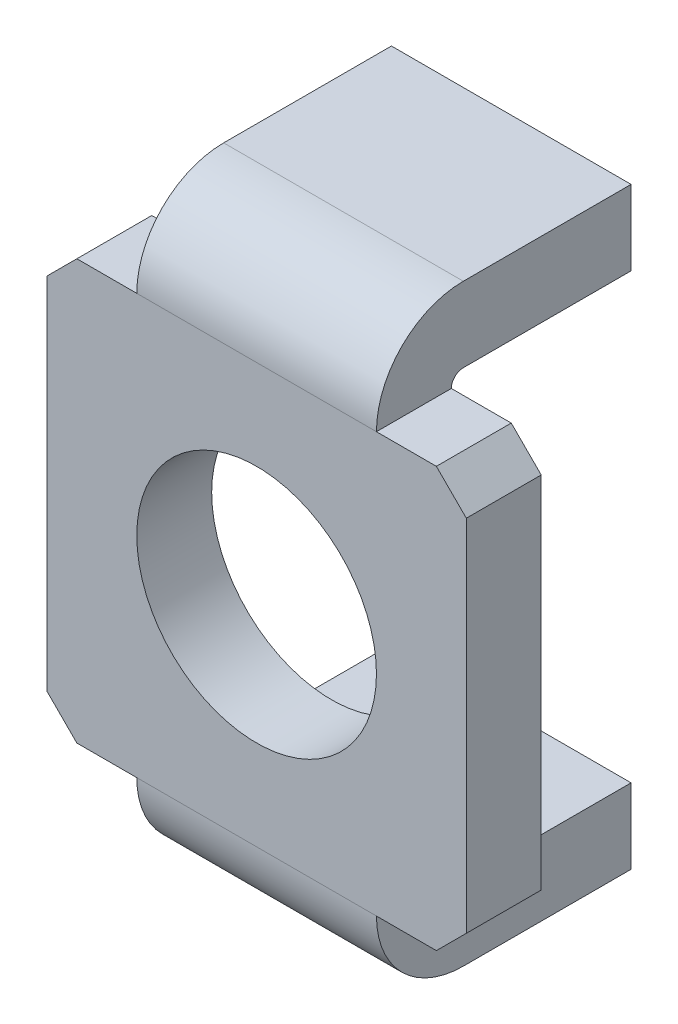
ISO-10303-21;
HEADER;
FILE_DESCRIPTION(('STEP AP214'),'2;1');
FILE_NAME('part.step','',(''),(''),'','','');
FILE_SCHEMA(('AUTOMOTIVE_DESIGN { 1 0 10303 214 1 1 1 1 }'));
ENDSEC;
DATA;
#1=APPLICATION_CONTEXT('core data for automotive mechanical design processes');
#2=APPLICATION_PROTOCOL_DEFINITION('international standard','automotive_design',2000,#1);
#3=PRODUCT_CONTEXT('',#1,'mechanical');
#4=PRODUCT('Part','Part','',(#3));
#5=PRODUCT_RELATED_PRODUCT_CATEGORY('part','',(#4));
#6=PRODUCT_DEFINITION_FORMATION('','',#4);
#7=PRODUCT_DEFINITION_CONTEXT('part definition',#1,'design');
#8=PRODUCT_DEFINITION('design','',#6,#7);
#9=PRODUCT_DEFINITION_SHAPE('','',#8);
#10=(LENGTH_UNIT() NAMED_UNIT(*) SI_UNIT(.MILLI.,.METRE.));
#11=(NAMED_UNIT(*) PLANE_ANGLE_UNIT() SI_UNIT($,.RADIAN.));
#12=(NAMED_UNIT(*) SI_UNIT($,.STERADIAN.) SOLID_ANGLE_UNIT());
#13=UNCERTAINTY_MEASURE_WITH_UNIT(LENGTH_MEASURE(1.E-05),#10,'distance_accuracy_value','');
#14=(GEOMETRIC_REPRESENTATION_CONTEXT(3) GLOBAL_UNCERTAINTY_ASSIGNED_CONTEXT((#13)) GLOBAL_UNIT_ASSIGNED_CONTEXT((#10,
#11,#12)) REPRESENTATION_CONTEXT('',''));
#15=CARTESIAN_POINT('',(0.,0.,0.));
#16=DIRECTION('',(0.,0.,1.));
#17=DIRECTION('',(1.,0.,0.));
#18=AXIS2_PLACEMENT_3D('',#15,#16,#17);
#19=CARTESIAN_POINT('',(0.,-4.95,0.));
#20=DIRECTION('',(0.,1.,0.));
#21=DIRECTION('',(0.,0.,1.));
#22=AXIS2_PLACEMENT_3D('',#19,#20,#21);
#23=PLANE('',#22);
#24=DIRECTION('',(0.,0.,1.));
#25=VECTOR('',#24,1.);
#26=CARTESIAN_POINT('',(-2.,-4.95000000000001,-4.25));
#27=LINE('',#26,#25);
#28=CARTESIAN_POINT('',(-2.,-4.95000000000001,-4.25));
#29=VERTEX_POINT('',#28);
#30=CARTESIAN_POINT('',(-2.,-4.95000000000001,-1.45));
#31=VERTEX_POINT('',#30);
#32=EDGE_CURVE('E189',#29,#31,#27,.T.);
#33=ORIENTED_EDGE('',*,*,#32,.F.);
#34=DIRECTION('',(1.,0.,0.));
#35=VECTOR('',#34,1.);
#36=CARTESIAN_POINT('',(-2.,-4.95000000000001,-4.25));
#37=LINE('',#36,#35);
#38=CARTESIAN_POINT('',(2.,-4.95,-4.25));
#39=VERTEX_POINT('',#38);
#40=EDGE_CURVE('E199',#39,#29,#37,.F.);
#41=ORIENTED_EDGE('',*,*,#40,.F.);
#42=DIRECTION('',(0.,0.,-1.));
#43=VECTOR('',#42,1.);
#44=CARTESIAN_POINT('',(2.,-4.95,-4.25));
#45=LINE('',#44,#43);
#46=CARTESIAN_POINT('',(2.,-4.95,-1.45));
#47=VERTEX_POINT('',#46);
#48=EDGE_CURVE('E192',#47,#39,#45,.T.);
#49=ORIENTED_EDGE('',*,*,#48,.F.);
#50=DIRECTION('',(-1.,0.,0.));
#51=VECTOR('',#50,1.);
#52=CARTESIAN_POINT('',(-2.,-4.95,-1.44999999999999));
#53=LINE('',#52,#51);
#54=EDGE_CURVE('E253',#31,#47,#53,.F.);
#55=ORIENTED_EDGE('',*,*,#54,.F.);
#56=EDGE_LOOP('',(#33,#41,#49,#55));
#57=FACE_BOUND('',#56,.T.);
#58=ADVANCED_FACE('F17',(#57),#23,.F.);
#59=CARTESIAN_POINT('',(0.,4.95,0.));
#60=DIRECTION('',(0.,-1.,0.));
#61=DIRECTION('',(0.,0.,-1.));
#62=AXIS2_PLACEMENT_3D('',#59,#60,#61);
#63=PLANE('',#62);
#64=DIRECTION('',(0.,0.,1.));
#65=VECTOR('',#64,1.);
#66=CARTESIAN_POINT('',(2.,4.95,-4.25));
#67=LINE('',#66,#65);
#68=CARTESIAN_POINT('',(2.,4.95,-1.45));
#69=VERTEX_POINT('',#68);
#70=CARTESIAN_POINT('',(2.,4.95000000000001,-4.25));
#71=VERTEX_POINT('',#70);
#72=EDGE_CURVE('E245',#69,#71,#67,.F.);
#73=ORIENTED_EDGE('',*,*,#72,.T.);
#74=DIRECTION('',(1.,0.,0.));
#75=VECTOR('',#74,1.);
#76=CARTESIAN_POINT('',(-2.,4.95000000000001,-4.25));
#77=LINE('',#76,#75);
#78=CARTESIAN_POINT('',(-2.,4.95000000000001,-4.25));
#79=VERTEX_POINT('',#78);
#80=EDGE_CURVE('E332',#71,#79,#77,.F.);
#81=ORIENTED_EDGE('',*,*,#80,.T.);
#82=DIRECTION('',(0.,0.,-1.));
#83=VECTOR('',#82,1.);
#84=CARTESIAN_POINT('',(-2.,4.95000000000001,-4.25));
#85=LINE('',#84,#83);
#86=CARTESIAN_POINT('',(-2.,4.95000000000001,-1.45));
#87=VERTEX_POINT('',#86);
#88=EDGE_CURVE('E337',#79,#87,#85,.F.);
#89=ORIENTED_EDGE('',*,*,#88,.T.);
#90=DIRECTION('',(1.,0.,0.));
#91=VECTOR('',#90,1.);
#92=CARTESIAN_POINT('',(2.,4.95,-1.45));
#93=LINE('',#92,#91);
#94=EDGE_CURVE('E246',#69,#87,#93,.F.);
#95=ORIENTED_EDGE('',*,*,#94,.F.);
#96=EDGE_LOOP('',(#73,#81,#89,#95));
#97=FACE_BOUND('',#96,.T.);
#98=ADVANCED_FACE('F349',(#97),#63,.F.);
#99=CARTESIAN_POINT('',(-2.,-4.95000000000001,-4.25));
#100=DIRECTION('',(-1.,0.,0.));
#101=DIRECTION('',(0.,0.,1.));
#102=AXIS2_PLACEMENT_3D('',#99,#100,#101);
#103=PLANE('',#102);
#104=DIRECTION('',(0.,0.,1.));
#105=VECTOR('',#104,1.);
#106=CARTESIAN_POINT('',(-2.,-3.7,0.));
#107=LINE('',#106,#105);
#108=CARTESIAN_POINT('',(-2.,-3.70000000000001,-4.25));
#109=VERTEX_POINT('',#108);
#110=CARTESIAN_POINT('',(-2.,-3.7,-1.45));
#111=VERTEX_POINT('',#110);
#112=EDGE_CURVE('E154',#109,#111,#107,.T.);
#113=ORIENTED_EDGE('',*,*,#112,.F.);
#114=DIRECTION('',(0.,1.,0.));
#115=VECTOR('',#114,1.);
#116=CARTESIAN_POINT('',(-2.,-4.95000000000001,-4.25));
#117=LINE('',#116,#115);
#118=EDGE_CURVE('E196',#29,#109,#117,.T.);
#119=ORIENTED_EDGE('',*,*,#118,.F.);
#120=ORIENTED_EDGE('',*,*,#32,.T.);
#121=CARTESIAN_POINT('',(-2.,-3.5,-1.45));
#122=DIRECTION('',(-1.,0.,0.));
#123=DIRECTION('',(0.,0.,1.));
#124=AXIS2_PLACEMENT_3D('',#121,#122,#123);
#125=CIRCLE('',#124,1.45);
#126=CARTESIAN_POINT('',(-2.,-3.5,0.));
#127=VERTEX_POINT('',#126);
#128=EDGE_CURVE('E198',#127,#31,#125,.F.);
#129=ORIENTED_EDGE('',*,*,#128,.F.);
#130=DIRECTION('',(0.,0.,-1.));
#131=VECTOR('',#130,1.);
#132=CARTESIAN_POINT('',(-2.,-3.5,-1.45));
#133=LINE('',#132,#131);
#134=CARTESIAN_POINT('',(-2.,-3.5,-1.25));
#135=VERTEX_POINT('',#134);
#136=EDGE_CURVE('E157',#135,#127,#133,.F.);
#137=ORIENTED_EDGE('',*,*,#136,.F.);
#138=CARTESIAN_POINT('',(-2.,-3.5,-1.45));
#139=DIRECTION('',(-1.,0.,0.));
#140=DIRECTION('',(0.,0.,1.));
#141=AXIS2_PLACEMENT_3D('',#138,#139,#140);
#142=CIRCLE('',#141,0.2);
#143=EDGE_CURVE('E20',#111,#135,#142,.T.);
#144=ORIENTED_EDGE('',*,*,#143,.F.);
#145=EDGE_LOOP('',(#113,#119,#120,#129,#137,#144));
#146=FACE_BOUND('',#145,.T.);
#147=ADVANCED_FACE('F152',(#146),#103,.T.);
#148=CARTESIAN_POINT('',(2.,-4.95000000000001,-4.25));
#149=DIRECTION('',(1.,0.,0.));
#150=DIRECTION('',(0.,0.,-1.));
#151=AXIS2_PLACEMENT_3D('',#148,#149,#150);
#152=PLANE('',#151);
#153=ORIENTED_EDGE('',*,*,#48,.T.);
#154=DIRECTION('',(0.,1.,0.));
#155=VECTOR('',#154,1.);
#156=CARTESIAN_POINT('',(2.,-4.95000000000001,-4.25));
#157=LINE('',#156,#155);
#158=CARTESIAN_POINT('',(2.,-3.70000000000001,-4.25));
#159=VERTEX_POINT('',#158);
#160=EDGE_CURVE('E276',#159,#39,#157,.F.);
#161=ORIENTED_EDGE('',*,*,#160,.F.);
#162=DIRECTION('',(0.,0.,1.));
#163=VECTOR('',#162,1.);
#164=CARTESIAN_POINT('',(2.,-3.7,0.));
#165=LINE('',#164,#163);
#166=CARTESIAN_POINT('',(2.,-3.7,-1.45));
#167=VERTEX_POINT('',#166);
#168=EDGE_CURVE('E171',#167,#159,#165,.F.);
#169=ORIENTED_EDGE('',*,*,#168,.F.);
#170=CARTESIAN_POINT('',(2.,-3.5,-1.45));
#171=DIRECTION('',(-1.,0.,0.));
#172=DIRECTION('',(0.,0.,1.));
#173=AXIS2_PLACEMENT_3D('',#170,#171,#172);
#174=CIRCLE('',#173,0.2);
#175=CARTESIAN_POINT('',(2.,-3.5,-1.25));
#176=VERTEX_POINT('',#175);
#177=EDGE_CURVE('E162',#167,#176,#174,.T.);
#178=ORIENTED_EDGE('',*,*,#177,.T.);
#179=DIRECTION('',(0.,0.,-1.));
#180=VECTOR('',#179,1.);
#181=CARTESIAN_POINT('',(2.,-3.5,-1.45));
#182=LINE('',#181,#180);
#183=CARTESIAN_POINT('',(2.,-3.5,0.));
#184=VERTEX_POINT('',#183);
#185=EDGE_CURVE('E260',#176,#184,#182,.F.);
#186=ORIENTED_EDGE('',*,*,#185,.T.);
#187=CARTESIAN_POINT('',(2.,-3.5,-1.45));
#188=DIRECTION('',(-1.,0.,0.));
#189=DIRECTION('',(0.,0.,1.));
#190=AXIS2_PLACEMENT_3D('',#187,#188,#189);
#191=CIRCLE('',#190,1.45);
#192=EDGE_CURVE('E250',#47,#184,#191,.T.);
#193=ORIENTED_EDGE('',*,*,#192,.F.);
#194=EDGE_LOOP('',(#153,#161,#169,#178,#186,#193));
#195=FACE_BOUND('',#194,.T.);
#196=ADVANCED_FACE('F288',(#195),#152,.T.);
#197=CARTESIAN_POINT('',(-2.,-4.95000000000001,-4.25));
#198=DIRECTION('',(0.,0.,-1.));
#199=DIRECTION('',(0.,1.,0.));
#200=AXIS2_PLACEMENT_3D('',#197,#198,#199);
#201=PLANE('',#200);
#202=ORIENTED_EDGE('',*,*,#40,.T.);
#203=ORIENTED_EDGE('',*,*,#118,.T.);
#204=DIRECTION('',(1.,0.,0.));
#205=VECTOR('',#204,1.);
#206=CARTESIAN_POINT('',(0.,-3.70000000000001,-4.25));
#207=LINE('',#206,#205);
#208=EDGE_CURVE('E170',#159,#109,#207,.F.);
#209=ORIENTED_EDGE('',*,*,#208,.F.);
#210=ORIENTED_EDGE('',*,*,#160,.T.);
#211=EDGE_LOOP('',(#202,#203,#209,#210));
#212=FACE_BOUND('',#211,.T.);
#213=ADVANCED_FACE('F286',(#212),#201,.T.);
#214=CARTESIAN_POINT('',(-2.,-3.5,-1.45));
#215=DIRECTION('',(-1.,0.,0.));
#216=DIRECTION('',(0.,0.,1.));
#217=AXIS2_PLACEMENT_3D('',#214,#215,#216);
#218=CYLINDRICAL_SURFACE('',#217,1.45);
#219=ORIENTED_EDGE('',*,*,#54,.T.);
#220=ORIENTED_EDGE('',*,*,#192,.T.);
#221=DIRECTION('',(-1.,0.,0.));
#222=VECTOR('',#221,1.);
#223=CARTESIAN_POINT('',(0.,-3.50000000000001,0.));
#224=LINE('',#223,#222);
#225=EDGE_CURVE('E270',#184,#127,#224,.T.);
#226=ORIENTED_EDGE('',*,*,#225,.T.);
#227=ORIENTED_EDGE('',*,*,#128,.T.);
#228=EDGE_LOOP('',(#219,#220,#226,#227));
#229=FACE_BOUND('',#228,.T.);
#230=ADVANCED_FACE('F294',(#229),#218,.T.);
#231=CARTESIAN_POINT('',(2.,3.5,-1.45));
#232=DIRECTION('',(1.,0.,0.));
#233=DIRECTION('',(0.,0.,-1.));
#234=AXIS2_PLACEMENT_3D('',#231,#232,#233);
#235=CYLINDRICAL_SURFACE('',#234,1.45);
#236=ORIENTED_EDGE('',*,*,#94,.T.);
#237=CARTESIAN_POINT('',(-2.,3.5,-1.45));
#238=DIRECTION('',(1.,0.,0.));
#239=DIRECTION('',(0.,0.,-1.));
#240=AXIS2_PLACEMENT_3D('',#237,#238,#239);
#241=CIRCLE('',#240,1.45);
#242=CARTESIAN_POINT('',(-2.,3.5,0.));
#243=VERTEX_POINT('',#242);
#244=EDGE_CURVE('E242',#87,#243,#241,.T.);
#245=ORIENTED_EDGE('',*,*,#244,.T.);
#246=DIRECTION('',(-1.,0.,0.));
#247=VECTOR('',#246,1.);
#248=CARTESIAN_POINT('',(0.,3.5,0.));
#249=LINE('',#248,#247);
#250=CARTESIAN_POINT('',(2.,3.5,0.));
#251=VERTEX_POINT('',#250);
#252=EDGE_CURVE('E343',#243,#251,#249,.F.);
#253=ORIENTED_EDGE('',*,*,#252,.T.);
#254=CARTESIAN_POINT('',(2.,3.5,-1.45));
#255=DIRECTION('',(1.,0.,0.));
#256=DIRECTION('',(0.,0.,-1.));
#257=AXIS2_PLACEMENT_3D('',#254,#255,#256);
#258=CIRCLE('',#257,1.45);
#259=EDGE_CURVE('E247',#251,#69,#258,.F.);
#260=ORIENTED_EDGE('',*,*,#259,.T.);
#261=EDGE_LOOP('',(#236,#245,#253,#260));
#262=FACE_BOUND('',#261,.T.);
#263=ADVANCED_FACE('F367',(#262),#235,.T.);
#264=CARTESIAN_POINT('',(2.,4.95000000000001,-4.25));
#265=DIRECTION('',(-1.,0.,0.));
#266=DIRECTION('',(0.,0.,1.));
#267=AXIS2_PLACEMENT_3D('',#264,#265,#266);
#268=PLANE('',#267);
#269=DIRECTION('',(0.,0.,-1.));
#270=VECTOR('',#269,1.);
#271=CARTESIAN_POINT('',(2.,3.7,0.));
#272=LINE('',#271,#270);
#273=CARTESIAN_POINT('',(2.,3.70000000000001,-4.25));
#274=VERTEX_POINT('',#273);
#275=CARTESIAN_POINT('',(2.,3.7,-1.45));
#276=VERTEX_POINT('',#275);
#277=EDGE_CURVE('E213',#274,#276,#272,.F.);
#278=ORIENTED_EDGE('',*,*,#277,.F.);
#279=DIRECTION('',(0.,-1.,0.));
#280=VECTOR('',#279,1.);
#281=CARTESIAN_POINT('',(2.,4.95000000000001,-4.25));
#282=LINE('',#281,#280);
#283=EDGE_CURVE('E334',#274,#71,#282,.F.);
#284=ORIENTED_EDGE('',*,*,#283,.T.);
#285=ORIENTED_EDGE('',*,*,#72,.F.);
#286=ORIENTED_EDGE('',*,*,#259,.F.);
#287=DIRECTION('',(0.,0.,1.));
#288=VECTOR('',#287,1.);
#289=CARTESIAN_POINT('',(2.,3.5,-1.45));
#290=LINE('',#289,#288);
#291=CARTESIAN_POINT('',(2.,3.5,-1.25));
#292=VERTEX_POINT('',#291);
#293=EDGE_CURVE('E259',#292,#251,#290,.T.);
#294=ORIENTED_EDGE('',*,*,#293,.F.);
#295=CARTESIAN_POINT('',(2.,3.5,-1.45));
#296=DIRECTION('',(1.,0.,0.));
#297=DIRECTION('',(0.,0.,-1.));
#298=AXIS2_PLACEMENT_3D('',#295,#296,#297);
#299=CIRCLE('',#298,0.2);
#300=EDGE_CURVE('E258',#276,#292,#299,.T.);
#301=ORIENTED_EDGE('',*,*,#300,.F.);
#302=EDGE_LOOP('',(#278,#284,#285,#286,#294,#301));
#303=FACE_BOUND('',#302,.T.);
#304=ADVANCED_FACE('F355',(#303),#268,.F.);
#305=CARTESIAN_POINT('',(-2.,4.95000000000001,-4.25));
#306=DIRECTION('',(1.,0.,0.));
#307=DIRECTION('',(0.,0.,-1.));
#308=AXIS2_PLACEMENT_3D('',#305,#306,#307);
#309=PLANE('',#308);
#310=ORIENTED_EDGE('',*,*,#88,.F.);
#311=DIRECTION('',(0.,-1.,0.));
#312=VECTOR('',#311,1.);
#313=CARTESIAN_POINT('',(-2.,4.95000000000001,-4.25));
#314=LINE('',#313,#312);
#315=CARTESIAN_POINT('',(-2.,3.70000000000001,-4.25));
#316=VERTEX_POINT('',#315);
#317=EDGE_CURVE('E172',#79,#316,#314,.T.);
#318=ORIENTED_EDGE('',*,*,#317,.T.);
#319=DIRECTION('',(0.,0.,-1.));
#320=VECTOR('',#319,1.);
#321=CARTESIAN_POINT('',(-2.,3.7,0.));
#322=LINE('',#321,#320);
#323=CARTESIAN_POINT('',(-2.,3.7,-1.45));
#324=VERTEX_POINT('',#323);
#325=EDGE_CURVE('E209',#324,#316,#322,.T.);
#326=ORIENTED_EDGE('',*,*,#325,.F.);
#327=CARTESIAN_POINT('',(-2.,3.5,-1.45));
#328=DIRECTION('',(1.,0.,0.));
#329=DIRECTION('',(0.,0.,-1.));
#330=AXIS2_PLACEMENT_3D('',#327,#328,#329);
#331=CIRCLE('',#330,0.2);
#332=CARTESIAN_POINT('',(-2.,3.5,-1.25));
#333=VERTEX_POINT('',#332);
#334=EDGE_CURVE('E255',#324,#333,#331,.T.);
#335=ORIENTED_EDGE('',*,*,#334,.T.);
#336=DIRECTION('',(0.,0.,1.));
#337=VECTOR('',#336,1.);
#338=CARTESIAN_POINT('',(-2.,3.5,-1.45));
#339=LINE('',#338,#337);
#340=EDGE_CURVE('E193',#333,#243,#339,.T.);
#341=ORIENTED_EDGE('',*,*,#340,.T.);
#342=ORIENTED_EDGE('',*,*,#244,.F.);
#343=EDGE_LOOP('',(#310,#318,#326,#335,#341,#342));
#344=FACE_BOUND('',#343,.T.);
#345=ADVANCED_FACE('F363',(#344),#309,.F.);
#346=CARTESIAN_POINT('',(-2.,4.95000000000001,-4.25));
#347=DIRECTION('',(0.,0.,1.));
#348=DIRECTION('',(0.,-1.,0.));
#349=AXIS2_PLACEMENT_3D('',#346,#347,#348);
#350=PLANE('',#349);
#351=ORIENTED_EDGE('',*,*,#317,.F.);
#352=ORIENTED_EDGE('',*,*,#80,.F.);
#353=ORIENTED_EDGE('',*,*,#283,.F.);
#354=DIRECTION('',(1.,0.,0.));
#355=VECTOR('',#354,1.);
#356=CARTESIAN_POINT('',(0.,3.70000000000001,-4.25));
#357=LINE('',#356,#355);
#358=EDGE_CURVE('E212',#316,#274,#357,.T.);
#359=ORIENTED_EDGE('',*,*,#358,.F.);
#360=EDGE_LOOP('',(#351,#352,#353,#359));
#361=FACE_BOUND('',#360,.T.);
#362=ADVANCED_FACE('F360',(#361),#350,.F.);
#363=CARTESIAN_POINT('',(0.,-3.7,0.));
#364=DIRECTION('',(0.,1.,0.));
#365=DIRECTION('',(0.,0.,1.));
#366=AXIS2_PLACEMENT_3D('',#363,#364,#365);
#367=PLANE('',#366);
#368=ORIENTED_EDGE('',*,*,#168,.T.);
#369=ORIENTED_EDGE('',*,*,#208,.T.);
#370=ORIENTED_EDGE('',*,*,#112,.T.);
#371=DIRECTION('',(-1.,0.,0.));
#372=VECTOR('',#371,1.);
#373=CARTESIAN_POINT('',(-2.,-3.7,-1.45));
#374=LINE('',#373,#372);
#375=EDGE_CURVE('E168',#111,#167,#374,.F.);
#376=ORIENTED_EDGE('',*,*,#375,.T.);
#377=EDGE_LOOP('',(#368,#369,#370,#376));
#378=FACE_BOUND('',#377,.T.);
#379=ADVANCED_FACE('F167',(#378),#367,.T.);
#380=CARTESIAN_POINT('',(0.,0.,0.));
#381=DIRECTION('',(0.,0.,-1.));
#382=DIRECTION('',(-1.,0.,0.));
#383=AXIS2_PLACEMENT_3D('',#380,#381,#382);
#384=PLANE('',#383);
#385=DIRECTION('',(-0.707106781186547,-0.707106781186548,0.));
#386=VECTOR('',#385,1.);
#387=CARTESIAN_POINT('',(3.,-3.5,0.));
#388=LINE('',#387,#386);
#389=CARTESIAN_POINT('',(3.,-3.5,0.));
#390=VERTEX_POINT('',#389);
#391=CARTESIAN_POINT('',(3.5,-2.99999999999999,0.));
#392=VERTEX_POINT('',#391);
#393=EDGE_CURVE('E321',#390,#392,#388,.F.);
#394=ORIENTED_EDGE('',*,*,#393,.T.);
#395=DIRECTION('',(0.,1.,0.));
#396=VECTOR('',#395,1.);
#397=CARTESIAN_POINT('',(3.5,3.5,0.));
#398=LINE('',#397,#396);
#399=CARTESIAN_POINT('',(3.5,3.,0.));
#400=VERTEX_POINT('',#399);
#401=EDGE_CURVE('E241',#400,#392,#398,.F.);
#402=ORIENTED_EDGE('',*,*,#401,.F.);
#403=DIRECTION('',(0.707106781186549,-0.707106781186546,0.));
#404=VECTOR('',#403,1.);
#405=CARTESIAN_POINT('',(3.,3.5,0.));
#406=LINE('',#405,#404);
#407=CARTESIAN_POINT('',(2.99999999999999,3.5,0.));
#408=VERTEX_POINT('',#407);
#409=EDGE_CURVE('E223',#408,#400,#406,.T.);
#410=ORIENTED_EDGE('',*,*,#409,.F.);
#411=DIRECTION('',(-1.,0.,0.));
#412=VECTOR('',#411,1.);
#413=CARTESIAN_POINT('',(0.,3.5,0.));
#414=LINE('',#413,#412);
#415=EDGE_CURVE('E267',#251,#408,#414,.F.);
#416=ORIENTED_EDGE('',*,*,#415,.F.);
#417=ORIENTED_EDGE('',*,*,#252,.F.);
#418=DIRECTION('',(-1.,0.,0.));
#419=VECTOR('',#418,1.);
#420=CARTESIAN_POINT('',(0.,3.5,0.));
#421=LINE('',#420,#419);
#422=CARTESIAN_POINT('',(-3.,3.5,0.));
#423=VERTEX_POINT('',#422);
#424=EDGE_CURVE('E329',#423,#243,#421,.F.);
#425=ORIENTED_EDGE('',*,*,#424,.F.);
#426=DIRECTION('',(0.707106781186547,0.707106781186548,0.));
#427=VECTOR('',#426,1.);
#428=CARTESIAN_POINT('',(-3.5,3.,0.));
#429=LINE('',#428,#427);
#430=CARTESIAN_POINT('',(-3.5,3.,0.));
#431=VERTEX_POINT('',#430);
#432=EDGE_CURVE('E272',#431,#423,#429,.T.);
#433=ORIENTED_EDGE('',*,*,#432,.F.);
#434=DIRECTION('',(0.,-1.,0.));
#435=VECTOR('',#434,1.);
#436=CARTESIAN_POINT('',(-3.5,3.5,0.));
#437=LINE('',#436,#435);
#438=CARTESIAN_POINT('',(-3.5,-3.,0.));
#439=VERTEX_POINT('',#438);
#440=EDGE_CURVE('E312',#439,#431,#437,.F.);
#441=ORIENTED_EDGE('',*,*,#440,.F.);
#442=DIRECTION('',(-0.707106781186549,0.707106781186546,0.));
#443=VECTOR('',#442,1.);
#444=CARTESIAN_POINT('',(-3.5,-3.,0.));
#445=LINE('',#444,#443);
#446=CARTESIAN_POINT('',(-3.,-3.5,0.));
#447=VERTEX_POINT('',#446);
#448=EDGE_CURVE('E181',#439,#447,#445,.F.);
#449=ORIENTED_EDGE('',*,*,#448,.T.);
#450=DIRECTION('',(1.,0.,0.));
#451=VECTOR('',#450,1.);
#452=CARTESIAN_POINT('',(3.5,-3.5,0.));
#453=LINE('',#452,#451);
#454=EDGE_CURVE('E177',#127,#447,#453,.F.);
#455=ORIENTED_EDGE('',*,*,#454,.F.);
#456=ORIENTED_EDGE('',*,*,#225,.F.);
#457=DIRECTION('',(1.,0.,0.));
#458=VECTOR('',#457,1.);
#459=CARTESIAN_POINT('',(3.5,-3.5,0.));
#460=LINE('',#459,#458);
#461=EDGE_CURVE('E178',#390,#184,#460,.F.);
#462=ORIENTED_EDGE('',*,*,#461,.F.);
#463=EDGE_LOOP('',(#394,#402,#410,#416,#417,#425,#433,#441,#449,#455,#456,#462));
#464=FACE_BOUND('',#463,.T.);
#465=CARTESIAN_POINT('',(0.,0.,0.));
#466=DIRECTION('',(0.,0.,1.));
#467=DIRECTION('',(1.,0.,0.));
#468=AXIS2_PLACEMENT_3D('',#465,#466,#467);
#469=CIRCLE('',#468,2.);
#470=CARTESIAN_POINT('',(2.,0.,0.));
#471=VERTEX_POINT('',#470);
#472=EDGE_CURVE('E238',#471,#471,#469,.F.);
#473=ORIENTED_EDGE('',*,*,#472,.T.);
#474=EDGE_LOOP('',(#473));
#475=FACE_BOUND('',#474,.T.);
#476=ADVANCED_FACE('F297',(#464,#475),#384,.F.);
#477=CARTESIAN_POINT('',(0.,3.7,0.));
#478=DIRECTION('',(0.,-1.,0.));
#479=DIRECTION('',(0.,0.,-1.));
#480=AXIS2_PLACEMENT_3D('',#477,#478,#479);
#481=PLANE('',#480);
#482=ORIENTED_EDGE('',*,*,#325,.T.);
#483=ORIENTED_EDGE('',*,*,#358,.T.);
#484=ORIENTED_EDGE('',*,*,#277,.T.);
#485=DIRECTION('',(1.,0.,0.));
#486=VECTOR('',#485,1.);
#487=CARTESIAN_POINT('',(2.,3.7,-1.45));
#488=LINE('',#487,#486);
#489=EDGE_CURVE('E214',#276,#324,#488,.F.);
#490=ORIENTED_EDGE('',*,*,#489,.T.);
#491=EDGE_LOOP('',(#482,#483,#484,#490));
#492=FACE_BOUND('',#491,.T.);
#493=ADVANCED_FACE('F381',(#492),#481,.T.);
#494=CARTESIAN_POINT('',(0.,0.,-1.25));
#495=DIRECTION('',(0.,0.,1.));
#496=DIRECTION('',(1.,0.,0.));
#497=AXIS2_PLACEMENT_3D('',#494,#495,#496);
#498=CYLINDRICAL_SURFACE('',#497,2.);
#499=ORIENTED_EDGE('',*,*,#472,.F.);
#500=EDGE_LOOP('',(#499));
#501=FACE_BOUND('',#500,.T.);
#502=CARTESIAN_POINT('',(0.,0.,-1.25));
#503=DIRECTION('',(0.,0.,1.));
#504=DIRECTION('',(1.,0.,0.));
#505=AXIS2_PLACEMENT_3D('',#502,#503,#504);
#506=CIRCLE('',#505,2.);
#507=CARTESIAN_POINT('',(2.,0.,-1.25));
#508=VERTEX_POINT('',#507);
#509=EDGE_CURVE('E234',#508,#508,#506,.T.);
#510=ORIENTED_EDGE('',*,*,#509,.F.);
#511=EDGE_LOOP('',(#510));
#512=FACE_BOUND('',#511,.T.);
#513=ADVANCED_FACE('F383',(#501,#512),#498,.F.);
#514=CARTESIAN_POINT('',(3.5,3.5,-1.25));
#515=DIRECTION('',(1.,0.,0.));
#516=DIRECTION('',(0.,1.,0.));
#517=AXIS2_PLACEMENT_3D('',#514,#515,#516);
#518=PLANE('',#517);
#519=DIRECTION('',(0.,1.,0.));
#520=VECTOR('',#519,1.);
#521=CARTESIAN_POINT('',(3.5,0.,-1.25));
#522=LINE('',#521,#520);
#523=CARTESIAN_POINT('',(3.5,3.,-1.25));
#524=VERTEX_POINT('',#523);
#525=CARTESIAN_POINT('',(3.5,-2.99999999999999,-1.25));
#526=VERTEX_POINT('',#525);
#527=EDGE_CURVE('E237',#524,#526,#522,.F.);
#528=ORIENTED_EDGE('',*,*,#527,.F.);
#529=DIRECTION('',(0.,0.,1.));
#530=VECTOR('',#529,1.);
#531=CARTESIAN_POINT('',(3.5,3.,-1.25));
#532=LINE('',#531,#530);
#533=EDGE_CURVE('E217',#524,#400,#532,.T.);
#534=ORIENTED_EDGE('',*,*,#533,.T.);
#535=ORIENTED_EDGE('',*,*,#401,.T.);
#536=DIRECTION('',(0.,0.,1.));
#537=VECTOR('',#536,1.);
#538=CARTESIAN_POINT('',(3.5,-2.99999999999999,-1.25));
#539=LINE('',#538,#537);
#540=EDGE_CURVE('E319',#392,#526,#539,.F.);
#541=ORIENTED_EDGE('',*,*,#540,.T.);
#542=EDGE_LOOP('',(#528,#534,#535,#541));
#543=FACE_BOUND('',#542,.T.);
#544=ADVANCED_FACE('F390',(#543),#518,.T.);
#545=CARTESIAN_POINT('',(3.,-3.5,-1.25));
#546=DIRECTION('',(-0.707106781186548,0.707106781186547,0.));
#547=DIRECTION('',(-0.707106781186547,-0.707106781186548,0.));
#548=AXIS2_PLACEMENT_3D('',#545,#546,#547);
#549=PLANE('',#548);
#550=ORIENTED_EDGE('',*,*,#540,.F.);
#551=ORIENTED_EDGE('',*,*,#393,.F.);
#552=DIRECTION('',(0.,0.,1.));
#553=VECTOR('',#552,1.);
#554=CARTESIAN_POINT('',(3.,-3.5,-1.25));
#555=LINE('',#554,#553);
#556=CARTESIAN_POINT('',(3.,-3.5,-1.25));
#557=VERTEX_POINT('',#556);
#558=EDGE_CURVE('E184',#557,#390,#555,.T.);
#559=ORIENTED_EDGE('',*,*,#558,.F.);
#560=DIRECTION('',(-0.707106781186547,-0.707106781186548,0.));
#561=VECTOR('',#560,1.);
#562=CARTESIAN_POINT('',(3.5,-2.99999999999999,-1.25));
#563=LINE('',#562,#561);
#564=EDGE_CURVE('E230',#526,#557,#563,.T.);
#565=ORIENTED_EDGE('',*,*,#564,.F.);
#566=EDGE_LOOP('',(#550,#551,#559,#565));
#567=FACE_BOUND('',#566,.T.);
#568=ADVANCED_FACE('F428',(#567),#549,.F.);
#569=CARTESIAN_POINT('',(3.5,-3.5,-1.25));
#570=DIRECTION('',(0.,-1.,0.));
#571=DIRECTION('',(1.,0.,0.));
#572=AXIS2_PLACEMENT_3D('',#569,#570,#571);
#573=PLANE('',#572);
#574=ORIENTED_EDGE('',*,*,#461,.T.);
#575=ORIENTED_EDGE('',*,*,#185,.F.);
#576=DIRECTION('',(-1.,0.,0.));
#577=VECTOR('',#576,1.);
#578=CARTESIAN_POINT('',(0.,-3.5,-1.25));
#579=LINE('',#578,#577);
#580=EDGE_CURVE('E227',#557,#176,#579,.T.);
#581=ORIENTED_EDGE('',*,*,#580,.F.);
#582=ORIENTED_EDGE('',*,*,#558,.T.);
#583=EDGE_LOOP('',(#574,#575,#581,#582));
#584=FACE_BOUND('',#583,.T.);
#585=ADVANCED_FACE('F425',(#584),#573,.T.);
#586=CARTESIAN_POINT('',(-2.,-3.5,-1.45));
#587=DIRECTION('',(-1.,0.,0.));
#588=DIRECTION('',(0.,0.,1.));
#589=AXIS2_PLACEMENT_3D('',#586,#587,#588);
#590=CYLINDRICAL_SURFACE('',#589,0.2);
#591=ORIENTED_EDGE('',*,*,#177,.F.);
#592=ORIENTED_EDGE('',*,*,#375,.F.);
#593=ORIENTED_EDGE('',*,*,#143,.T.);
#594=DIRECTION('',(-1.,0.,0.));
#595=VECTOR('',#594,1.);
#596=CARTESIAN_POINT('',(0.,-3.5,-1.25));
#597=LINE('',#596,#595);
#598=EDGE_CURVE('E224',#176,#135,#597,.T.);
#599=ORIENTED_EDGE('',*,*,#598,.F.);
#600=EDGE_LOOP('',(#591,#592,#593,#599));
#601=FACE_BOUND('',#600,.T.);
#602=ADVANCED_FACE('F174',(#601),#590,.F.);
#603=CARTESIAN_POINT('',(3.5,-3.5,-1.25));
#604=DIRECTION('',(0.,-1.,0.));
#605=DIRECTION('',(1.,0.,0.));
#606=AXIS2_PLACEMENT_3D('',#603,#604,#605);
#607=PLANE('',#606);
#608=DIRECTION('',(-1.,0.,0.));
#609=VECTOR('',#608,1.);
#610=CARTESIAN_POINT('',(0.,-3.5,-1.25));
#611=LINE('',#610,#609);
#612=CARTESIAN_POINT('',(-3.,-3.5,-1.25));
#613=VERTEX_POINT('',#612);
#614=EDGE_CURVE('E226',#135,#613,#611,.T.);
#615=ORIENTED_EDGE('',*,*,#614,.F.);
#616=ORIENTED_EDGE('',*,*,#136,.T.);
#617=ORIENTED_EDGE('',*,*,#454,.T.);
#618=DIRECTION('',(0.,0.,1.));
#619=VECTOR('',#618,1.);
#620=CARTESIAN_POINT('',(-3.,-3.5,-1.25));
#621=LINE('',#620,#619);
#622=EDGE_CURVE('E304',#447,#613,#621,.F.);
#623=ORIENTED_EDGE('',*,*,#622,.T.);
#624=EDGE_LOOP('',(#615,#616,#617,#623));
#625=FACE_BOUND('',#624,.T.);
#626=ADVANCED_FACE('F303',(#625),#607,.T.);
#627=CARTESIAN_POINT('',(-3.5,-3.,-1.25));
#628=DIRECTION('',(0.707106781186546,0.707106781186549,0.));
#629=DIRECTION('',(-0.707106781186549,0.707106781186546,0.));
#630=AXIS2_PLACEMENT_3D('',#627,#628,#629);
#631=PLANE('',#630);
#632=ORIENTED_EDGE('',*,*,#622,.F.);
#633=ORIENTED_EDGE('',*,*,#448,.F.);
#634=DIRECTION('',(0.,0.,1.));
#635=VECTOR('',#634,1.);
#636=CARTESIAN_POINT('',(-3.5,-3.,-1.25));
#637=LINE('',#636,#635);
#638=CARTESIAN_POINT('',(-3.5,-3.,-1.25));
#639=VERTEX_POINT('',#638);
#640=EDGE_CURVE('E309',#639,#439,#637,.T.);
#641=ORIENTED_EDGE('',*,*,#640,.F.);
#642=DIRECTION('',(-0.707106781186549,0.707106781186546,0.));
#643=VECTOR('',#642,1.);
#644=CARTESIAN_POINT('',(-3.,-3.5,-1.25));
#645=LINE('',#644,#643);
#646=EDGE_CURVE('E233',#613,#639,#645,.T.);
#647=ORIENTED_EDGE('',*,*,#646,.F.);
#648=EDGE_LOOP('',(#632,#633,#641,#647));
#649=FACE_BOUND('',#648,.T.);
#650=ADVANCED_FACE('F307',(#649),#631,.F.);
#651=CARTESIAN_POINT('',(-3.5,3.5,-1.25));
#652=DIRECTION('',(-1.,0.,0.));
#653=DIRECTION('',(0.,-1.,0.));
#654=AXIS2_PLACEMENT_3D('',#651,#652,#653);
#655=PLANE('',#654);
#656=ORIENTED_EDGE('',*,*,#440,.T.);
#657=DIRECTION('',(0.,0.,1.));
#658=VECTOR('',#657,1.);
#659=CARTESIAN_POINT('',(-3.5,3.,-1.25));
#660=LINE('',#659,#658);
#661=CARTESIAN_POINT('',(-3.5,3.,-1.25));
#662=VERTEX_POINT('',#661);
#663=EDGE_CURVE('E450',#431,#662,#660,.F.);
#664=ORIENTED_EDGE('',*,*,#663,.T.);
#665=DIRECTION('',(0.,1.,0.));
#666=VECTOR('',#665,1.);
#667=CARTESIAN_POINT('',(-3.5,0.,-1.25));
#668=LINE('',#667,#666);
#669=EDGE_CURVE('E456',#639,#662,#668,.T.);
#670=ORIENTED_EDGE('',*,*,#669,.F.);
#671=ORIENTED_EDGE('',*,*,#640,.T.);
#672=EDGE_LOOP('',(#656,#664,#670,#671));
#673=FACE_BOUND('',#672,.T.);
#674=ADVANCED_FACE('F414',(#673),#655,.T.);
#675=CARTESIAN_POINT('',(-3.,3.5,-1.25));
#676=DIRECTION('',(0.707106781186549,-0.707106781186546,0.));
#677=DIRECTION('',(0.707106781186546,0.707106781186549,0.));
#678=AXIS2_PLACEMENT_3D('',#675,#676,#677);
#679=PLANE('',#678);
#680=ORIENTED_EDGE('',*,*,#663,.F.);
#681=ORIENTED_EDGE('',*,*,#432,.T.);
#682=DIRECTION('',(0.,0.,1.));
#683=VECTOR('',#682,1.);
#684=CARTESIAN_POINT('',(-3.,3.5,-1.25));
#685=LINE('',#684,#683);
#686=CARTESIAN_POINT('',(-3.,3.5,-1.25));
#687=VERTEX_POINT('',#686);
#688=EDGE_CURVE('E218',#687,#423,#685,.T.);
#689=ORIENTED_EDGE('',*,*,#688,.F.);
#690=DIRECTION('',(0.707106781186547,0.707106781186548,0.));
#691=VECTOR('',#690,1.);
#692=CARTESIAN_POINT('',(-3.5,3.,-1.25));
#693=LINE('',#692,#691);
#694=EDGE_CURVE('E208',#662,#687,#693,.T.);
#695=ORIENTED_EDGE('',*,*,#694,.F.);
#696=EDGE_LOOP('',(#680,#681,#689,#695));
#697=FACE_BOUND('',#696,.T.);
#698=ADVANCED_FACE('F410',(#697),#679,.F.);
#699=CARTESIAN_POINT('',(3.5,3.5,-1.25));
#700=DIRECTION('',(0.,1.,0.));
#701=DIRECTION('',(0.,0.,1.));
#702=AXIS2_PLACEMENT_3D('',#699,#700,#701);
#703=PLANE('',#702);
#704=ORIENTED_EDGE('',*,*,#424,.T.);
#705=ORIENTED_EDGE('',*,*,#340,.F.);
#706=DIRECTION('',(-1.,0.,0.));
#707=VECTOR('',#706,1.);
#708=CARTESIAN_POINT('',(0.,3.5,-1.25));
#709=LINE('',#708,#707);
#710=EDGE_CURVE('E205',#687,#333,#709,.F.);
#711=ORIENTED_EDGE('',*,*,#710,.F.);
#712=ORIENTED_EDGE('',*,*,#688,.T.);
#713=EDGE_LOOP('',(#704,#705,#711,#712));
#714=FACE_BOUND('',#713,.T.);
#715=ADVANCED_FACE('F407',(#714),#703,.T.);
#716=CARTESIAN_POINT('',(2.,3.5,-1.45));
#717=DIRECTION('',(1.,0.,0.));
#718=DIRECTION('',(0.,0.,-1.));
#719=AXIS2_PLACEMENT_3D('',#716,#717,#718);
#720=CYLINDRICAL_SURFACE('',#719,0.2);
#721=ORIENTED_EDGE('',*,*,#334,.F.);
#722=ORIENTED_EDGE('',*,*,#489,.F.);
#723=ORIENTED_EDGE('',*,*,#300,.T.);
#724=DIRECTION('',(-1.,0.,0.));
#725=VECTOR('',#724,1.);
#726=CARTESIAN_POINT('',(0.,3.5,-1.25));
#727=LINE('',#726,#725);
#728=EDGE_CURVE('E202',#333,#292,#727,.F.);
#729=ORIENTED_EDGE('',*,*,#728,.F.);
#730=EDGE_LOOP('',(#721,#722,#723,#729));
#731=FACE_BOUND('',#730,.T.);
#732=ADVANCED_FACE('F379',(#731),#720,.F.);
#733=CARTESIAN_POINT('',(3.5,3.5,-1.25));
#734=DIRECTION('',(0.,1.,0.));
#735=DIRECTION('',(0.,0.,1.));
#736=AXIS2_PLACEMENT_3D('',#733,#734,#735);
#737=PLANE('',#736);
#738=DIRECTION('',(-1.,0.,0.));
#739=VECTOR('',#738,1.);
#740=CARTESIAN_POINT('',(0.,3.5,-1.25));
#741=LINE('',#740,#739);
#742=CARTESIAN_POINT('',(3.,3.5,-1.25));
#743=VERTEX_POINT('',#742);
#744=EDGE_CURVE('E26',#292,#743,#741,.F.);
#745=ORIENTED_EDGE('',*,*,#744,.F.);
#746=ORIENTED_EDGE('',*,*,#293,.T.);
#747=ORIENTED_EDGE('',*,*,#415,.T.);
#748=DIRECTION('',(0.,0.,1.));
#749=VECTOR('',#748,1.);
#750=CARTESIAN_POINT('',(3.,3.5,-1.25));
#751=LINE('',#750,#749);
#752=EDGE_CURVE('E35',#408,#743,#751,.F.);
#753=ORIENTED_EDGE('',*,*,#752,.T.);
#754=EDGE_LOOP('',(#745,#746,#747,#753));
#755=FACE_BOUND('',#754,.T.);
#756=ADVANCED_FACE('F370',(#755),#737,.T.);
#757=CARTESIAN_POINT('',(3.5,3.,-1.25));
#758=DIRECTION('',(-0.707106781186546,-0.707106781186549,0.));
#759=DIRECTION('',(0.707106781186549,-0.707106781186546,0.));
#760=AXIS2_PLACEMENT_3D('',#757,#758,#759);
#761=PLANE('',#760);
#762=ORIENTED_EDGE('',*,*,#752,.F.);
#763=ORIENTED_EDGE('',*,*,#409,.T.);
#764=ORIENTED_EDGE('',*,*,#533,.F.);
#765=DIRECTION('',(0.707106781186549,-0.707106781186546,0.));
#766=VECTOR('',#765,1.);
#767=CARTESIAN_POINT('',(2.99999999999999,3.5,-1.25));
#768=LINE('',#767,#766);
#769=EDGE_CURVE('E11',#743,#524,#768,.T.);
#770=ORIENTED_EDGE('',*,*,#769,.F.);
#771=EDGE_LOOP('',(#762,#763,#764,#770));
#772=FACE_BOUND('',#771,.T.);
#773=ADVANCED_FACE('F395',(#772),#761,.F.);
#774=CARTESIAN_POINT('',(0.,0.,-1.25));
#775=DIRECTION('',(0.,0.,-1.));
#776=DIRECTION('',(-1.,0.,0.));
#777=AXIS2_PLACEMENT_3D('',#774,#775,#776);
#778=PLANE('',#777);
#779=ORIENTED_EDGE('',*,*,#744,.T.);
#780=ORIENTED_EDGE('',*,*,#769,.T.);
#781=ORIENTED_EDGE('',*,*,#527,.T.);
#782=ORIENTED_EDGE('',*,*,#564,.T.);
#783=ORIENTED_EDGE('',*,*,#580,.T.);
#784=ORIENTED_EDGE('',*,*,#598,.T.);
#785=ORIENTED_EDGE('',*,*,#614,.T.);
#786=ORIENTED_EDGE('',*,*,#646,.T.);
#787=ORIENTED_EDGE('',*,*,#669,.T.);
#788=ORIENTED_EDGE('',*,*,#694,.T.);
#789=ORIENTED_EDGE('',*,*,#710,.T.);
#790=ORIENTED_EDGE('',*,*,#728,.T.);
#791=EDGE_LOOP('',(#779,#780,#781,#782,#783,#784,#785,#786,#787,#788,#789,#790));
#792=FACE_BOUND('',#791,.T.);
#793=ORIENTED_EDGE('',*,*,#509,.T.);
#794=EDGE_LOOP('',(#793));
#795=FACE_BOUND('',#794,.T.);
#796=ADVANCED_FACE('F372',(#792,#795),#778,.T.);
#797=CLOSED_SHELL('',(#58,#98,#147,#196,#213,#230,#263,#304,#345,#362,#379,#476,#493,#513,#544,
#568,#585,#602,#626,#650,#674,#698,#715,#732,#756,#773,#796));
#798=MANIFOLD_SOLID_BREP('B1',#797);
#799=ADVANCED_BREP_SHAPE_REPRESENTATION('',(#18,#798),#14);
#800=SHAPE_DEFINITION_REPRESENTATION(#9,#799);
ENDSEC;
END-ISO-10303-21;
